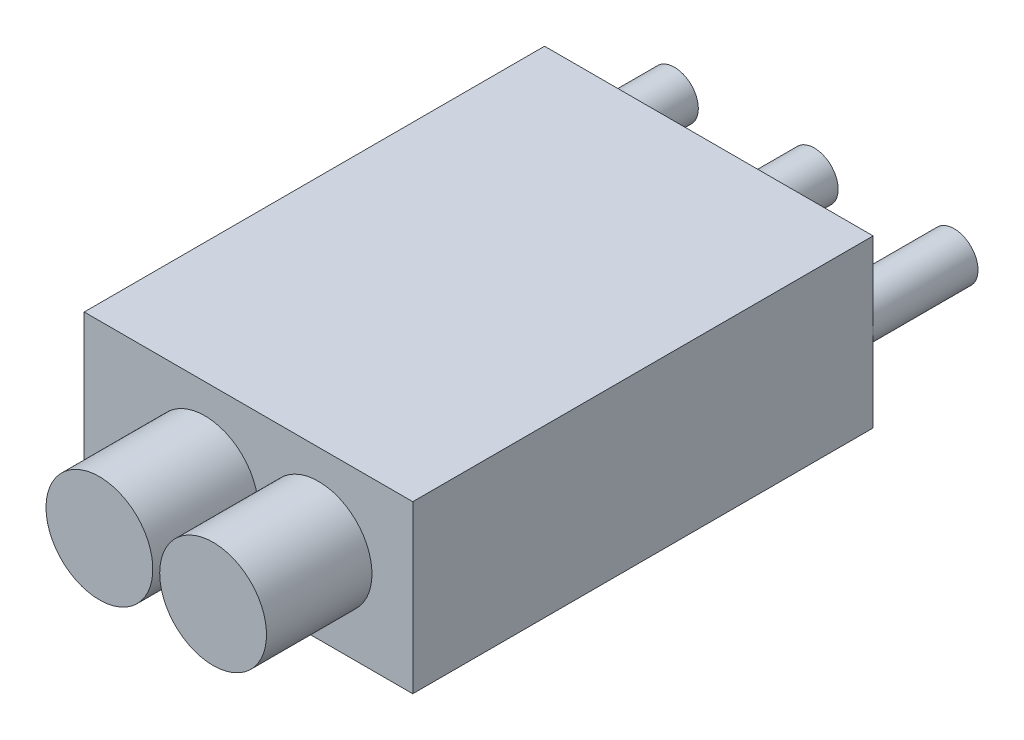
ISO-10303-21;
HEADER;
FILE_DESCRIPTION(('STEP AP214'),'2;1');
FILE_NAME('part.step','',(''),(''),'','','');
FILE_SCHEMA(('AUTOMOTIVE_DESIGN { 1 0 10303 214 1 1 1 1 }'));
ENDSEC;
DATA;
#1=APPLICATION_CONTEXT('core data for automotive mechanical design processes');
#2=APPLICATION_PROTOCOL_DEFINITION('international standard','automotive_design',2000,#1);
#3=PRODUCT_CONTEXT('',#1,'mechanical');
#4=PRODUCT('Part','Part','',(#3));
#5=PRODUCT_RELATED_PRODUCT_CATEGORY('part','',(#4));
#6=PRODUCT_DEFINITION_FORMATION('','',#4);
#7=PRODUCT_DEFINITION_CONTEXT('part definition',#1,'design');
#8=PRODUCT_DEFINITION('design','',#6,#7);
#9=PRODUCT_DEFINITION_SHAPE('','',#8);
#10=(LENGTH_UNIT() NAMED_UNIT(*) SI_UNIT(.MILLI.,.METRE.));
#11=(NAMED_UNIT(*) PLANE_ANGLE_UNIT() SI_UNIT($,.RADIAN.));
#12=(NAMED_UNIT(*) SI_UNIT($,.STERADIAN.) SOLID_ANGLE_UNIT());
#13=UNCERTAINTY_MEASURE_WITH_UNIT(LENGTH_MEASURE(1.E-05),#10,'distance_accuracy_value','');
#14=(GEOMETRIC_REPRESENTATION_CONTEXT(3) GLOBAL_UNCERTAINTY_ASSIGNED_CONTEXT((#13)) GLOBAL_UNIT_ASSIGNED_CONTEXT((#10,
#11,#12)) REPRESENTATION_CONTEXT('',''));
#15=CARTESIAN_POINT('',(0.,0.,0.));
#16=DIRECTION('',(0.,0.,1.));
#17=DIRECTION('',(1.,0.,0.));
#18=AXIS2_PLACEMENT_3D('',#15,#16,#17);
#19=CARTESIAN_POINT('',(-15.58,15.78,21.83));
#20=DIRECTION('',(1.,0.,0.));
#21=DIRECTION('',(0.,0.,-1.));
#22=AXIS2_PLACEMENT_3D('',#19,#20,#21);
#23=PLANE('',#22);
#24=DIRECTION('',(0.,0.,1.));
#25=VECTOR('',#24,1.);
#26=CARTESIAN_POINT('',(-15.58,0.,21.83));
#27=LINE('',#26,#25);
#28=CARTESIAN_POINT('',(-15.58,0.,-21.83));
#29=VERTEX_POINT('',#28);
#30=CARTESIAN_POINT('',(-15.58,0.,21.83));
#31=VERTEX_POINT('',#30);
#32=EDGE_CURVE('E114',#29,#31,#27,.T.);
#33=ORIENTED_EDGE('',*,*,#32,.T.);
#34=DIRECTION('',(0.,-1.,0.));
#35=VECTOR('',#34,1.);
#36=CARTESIAN_POINT('',(-15.58,15.78,21.83));
#37=LINE('',#36,#35);
#38=CARTESIAN_POINT('',(-15.58,15.78,21.83));
#39=VERTEX_POINT('',#38);
#40=EDGE_CURVE('E103',#39,#31,#37,.T.);
#41=ORIENTED_EDGE('',*,*,#40,.F.);
#42=DIRECTION('',(0.,0.,1.));
#43=VECTOR('',#42,1.);
#44=CARTESIAN_POINT('',(-15.58,15.78,21.83));
#45=LINE('',#44,#43);
#46=CARTESIAN_POINT('',(-15.58,15.78,-21.83));
#47=VERTEX_POINT('',#46);
#48=EDGE_CURVE('E95',#47,#39,#45,.T.);
#49=ORIENTED_EDGE('',*,*,#48,.F.);
#50=DIRECTION('',(0.,-1.,0.));
#51=VECTOR('',#50,1.);
#52=CARTESIAN_POINT('',(-15.58,15.78,-21.83));
#53=LINE('',#52,#51);
#54=EDGE_CURVE('E110',#47,#29,#53,.T.);
#55=ORIENTED_EDGE('',*,*,#54,.T.);
#56=EDGE_LOOP('',(#33,#41,#49,#55));
#57=FACE_BOUND('',#56,.T.);
#58=ADVANCED_FACE('F42',(#57),#23,.F.);
#59=CARTESIAN_POINT('',(15.58,15.78,21.83));
#60=DIRECTION('',(0.,0.,-1.));
#61=DIRECTION('',(-1.,0.,0.));
#62=AXIS2_PLACEMENT_3D('',#59,#60,#61);
#63=PLANE('',#62);
#64=CARTESIAN_POINT('',(6.64344064831066,7.91478895764295,21.83));
#65=DIRECTION('',(0.,0.,-1.));
#66=DIRECTION('',(-1.,0.,0.));
#67=AXIS2_PLACEMENT_3D('',#64,#65,#66);
#68=CIRCLE('',#67,5.065);
#69=CARTESIAN_POINT('',(1.57844064831066,7.91478895764295,21.83));
#70=VERTEX_POINT('',#69);
#71=EDGE_CURVE('E324',#70,#70,#68,.T.);
#72=ORIENTED_EDGE('',*,*,#71,.T.);
#73=EDGE_LOOP('',(#72));
#74=FACE_BOUND('',#73,.T.);
#75=CARTESIAN_POINT('',(-4.13975592637268,7.91478895764295,21.83));
#76=DIRECTION('',(0.,0.,-1.));
#77=DIRECTION('',(-1.,0.,0.));
#78=AXIS2_PLACEMENT_3D('',#75,#76,#77);
#79=CIRCLE('',#78,5.065);
#80=CARTESIAN_POINT('',(-9.20475592637268,7.91478895764295,21.83));
#81=VERTEX_POINT('',#80);
#82=EDGE_CURVE('E328',#81,#81,#79,.T.);
#83=ORIENTED_EDGE('',*,*,#82,.T.);
#84=EDGE_LOOP('',(#83));
#85=FACE_BOUND('',#84,.T.);
#86=DIRECTION('',(1.,0.,0.));
#87=VECTOR('',#86,1.);
#88=CARTESIAN_POINT('',(15.58,0.,21.83));
#89=LINE('',#88,#87);
#90=CARTESIAN_POINT('',(15.58,0.,21.83));
#91=VERTEX_POINT('',#90);
#92=EDGE_CURVE('E101',#31,#91,#89,.T.);
#93=ORIENTED_EDGE('',*,*,#92,.T.);
#94=DIRECTION('',(0.,-1.,0.));
#95=VECTOR('',#94,1.);
#96=CARTESIAN_POINT('',(15.58,15.78,21.83));
#97=LINE('',#96,#95);
#98=CARTESIAN_POINT('',(15.58,15.78,21.83));
#99=VERTEX_POINT('',#98);
#100=EDGE_CURVE('E99',#99,#91,#97,.T.);
#101=ORIENTED_EDGE('',*,*,#100,.F.);
#102=DIRECTION('',(1.,0.,0.));
#103=VECTOR('',#102,1.);
#104=CARTESIAN_POINT('',(15.58,15.78,21.83));
#105=LINE('',#104,#103);
#106=EDGE_CURVE('E90',#39,#99,#105,.T.);
#107=ORIENTED_EDGE('',*,*,#106,.F.);
#108=ORIENTED_EDGE('',*,*,#40,.T.);
#109=EDGE_LOOP('',(#93,#101,#107,#108));
#110=FACE_BOUND('',#109,.T.);
#111=ADVANCED_FACE('F100',(#74,#85,#110),#63,.F.);
#112=CARTESIAN_POINT('',(15.58,15.78,21.83));
#113=DIRECTION('',(-1.,0.,0.));
#114=DIRECTION('',(0.,0.,1.));
#115=AXIS2_PLACEMENT_3D('',#112,#113,#114);
#116=PLANE('',#115);
#117=DIRECTION('',(0.,0.,-1.));
#118=VECTOR('',#117,1.);
#119=CARTESIAN_POINT('',(15.58,0.,21.83));
#120=LINE('',#119,#118);
#121=CARTESIAN_POINT('',(15.58,0.,-21.83));
#122=VERTEX_POINT('',#121);
#123=EDGE_CURVE('E76',#91,#122,#120,.T.);
#124=ORIENTED_EDGE('',*,*,#123,.T.);
#125=DIRECTION('',(0.,-1.,0.));
#126=VECTOR('',#125,1.);
#127=CARTESIAN_POINT('',(15.58,15.78,-21.83));
#128=LINE('',#127,#126);
#129=CARTESIAN_POINT('',(15.58,15.78,-21.83));
#130=VERTEX_POINT('',#129);
#131=EDGE_CURVE('E104',#130,#122,#128,.T.);
#132=ORIENTED_EDGE('',*,*,#131,.F.);
#133=DIRECTION('',(0.,0.,-1.));
#134=VECTOR('',#133,1.);
#135=CARTESIAN_POINT('',(15.58,15.78,21.83));
#136=LINE('',#135,#134);
#137=EDGE_CURVE('E93',#99,#130,#136,.T.);
#138=ORIENTED_EDGE('',*,*,#137,.F.);
#139=ORIENTED_EDGE('',*,*,#100,.T.);
#140=EDGE_LOOP('',(#124,#132,#138,#139));
#141=FACE_BOUND('',#140,.T.);
#142=ADVANCED_FACE('F106',(#141),#116,.F.);
#143=CARTESIAN_POINT('',(15.58,15.78,-21.83));
#144=DIRECTION('',(0.,0.,1.));
#145=DIRECTION('',(1.,0.,0.));
#146=AXIS2_PLACEMENT_3D('',#143,#144,#145);
#147=PLANE('',#146);
#148=CARTESIAN_POINT('',(-13.2620923389784,7.94959919089981,-21.83));
#149=DIRECTION('',(0.,0.,1.));
#150=DIRECTION('',(1.,0.,0.));
#151=AXIS2_PLACEMENT_3D('',#148,#149,#150);
#152=CIRCLE('',#151,2.265);
#153=CARTESIAN_POINT('',(-10.9970923389784,7.94959919089981,-21.83));
#154=VERTEX_POINT('',#153);
#155=EDGE_CURVE('E11',#154,#154,#152,.F.);
#156=ORIENTED_EDGE('',*,*,#155,.F.);
#157=EDGE_LOOP('',(#156));
#158=FACE_BOUND('',#157,.T.);
#159=CARTESIAN_POINT('',(0.,7.94959919089981,-21.83));
#160=DIRECTION('',(0.,0.,1.));
#161=DIRECTION('',(1.,0.,0.));
#162=AXIS2_PLACEMENT_3D('',#159,#160,#161);
#163=CIRCLE('',#162,2.265);
#164=CARTESIAN_POINT('',(2.265,7.94959919089981,-21.83));
#165=VERTEX_POINT('',#164);
#166=EDGE_CURVE('E51',#165,#165,#163,.F.);
#167=ORIENTED_EDGE('',*,*,#166,.F.);
#168=EDGE_LOOP('',(#167));
#169=FACE_BOUND('',#168,.T.);
#170=CARTESIAN_POINT('',(13.2620923389784,7.94959919089981,-21.83));
#171=DIRECTION('',(0.,0.,1.));
#172=DIRECTION('',(1.,0.,0.));
#173=AXIS2_PLACEMENT_3D('',#170,#171,#172);
#174=CIRCLE('',#173,2.265);
#175=CARTESIAN_POINT('',(15.5270923389784,7.94959919089981,-21.83));
#176=VERTEX_POINT('',#175);
#177=EDGE_CURVE('E131',#176,#176,#174,.F.);
#178=ORIENTED_EDGE('',*,*,#177,.F.);
#179=EDGE_LOOP('',(#178));
#180=FACE_BOUND('',#179,.T.);
#181=DIRECTION('',(-1.,0.,0.));
#182=VECTOR('',#181,1.);
#183=CARTESIAN_POINT('',(15.58,0.,-21.83));
#184=LINE('',#183,#182);
#185=EDGE_CURVE('E82',#122,#29,#184,.T.);
#186=ORIENTED_EDGE('',*,*,#185,.T.);
#187=ORIENTED_EDGE('',*,*,#54,.F.);
#188=DIRECTION('',(-1.,0.,0.));
#189=VECTOR('',#188,1.);
#190=CARTESIAN_POINT('',(15.58,15.78,-21.83));
#191=LINE('',#190,#189);
#192=EDGE_CURVE('E59',#130,#47,#191,.T.);
#193=ORIENTED_EDGE('',*,*,#192,.F.);
#194=ORIENTED_EDGE('',*,*,#131,.T.);
#195=EDGE_LOOP('',(#186,#187,#193,#194));
#196=FACE_BOUND('',#195,.T.);
#197=ADVANCED_FACE('F140',(#158,#169,#180,#196),#147,.F.);
#198=CARTESIAN_POINT('',(0.,15.78,0.));
#199=DIRECTION('',(0.,1.,0.));
#200=DIRECTION('',(0.,0.,1.));
#201=AXIS2_PLACEMENT_3D('',#198,#199,#200);
#202=PLANE('',#201);
#203=ORIENTED_EDGE('',*,*,#48,.T.);
#204=ORIENTED_EDGE('',*,*,#106,.T.);
#205=ORIENTED_EDGE('',*,*,#137,.T.);
#206=ORIENTED_EDGE('',*,*,#192,.T.);
#207=EDGE_LOOP('',(#203,#204,#205,#206));
#208=FACE_BOUND('',#207,.T.);
#209=ADVANCED_FACE('F91',(#208),#202,.T.);
#210=CARTESIAN_POINT('',(0.,0.,0.));
#211=DIRECTION('',(0.,1.,0.));
#212=DIRECTION('',(0.,0.,1.));
#213=AXIS2_PLACEMENT_3D('',#210,#211,#212);
#214=PLANE('',#213);
#215=ORIENTED_EDGE('',*,*,#32,.F.);
#216=ORIENTED_EDGE('',*,*,#185,.F.);
#217=ORIENTED_EDGE('',*,*,#123,.F.);
#218=ORIENTED_EDGE('',*,*,#92,.F.);
#219=EDGE_LOOP('',(#215,#216,#217,#218));
#220=FACE_BOUND('',#219,.T.);
#221=ADVANCED_FACE('F172',(#220),#214,.F.);
#222=CARTESIAN_POINT('',(-4.13975592637268,7.91478895764295,31.83));
#223=DIRECTION('',(0.,0.,-1.));
#224=DIRECTION('',(-1.,0.,0.));
#225=AXIS2_PLACEMENT_3D('',#222,#223,#224);
#226=CYLINDRICAL_SURFACE('',#225,5.065);
#227=CARTESIAN_POINT('',(-4.13975592637268,7.91478895764295,31.83));
#228=DIRECTION('',(0.,0.,-1.));
#229=DIRECTION('',(-1.,0.,0.));
#230=AXIS2_PLACEMENT_3D('',#227,#228,#229);
#231=CIRCLE('',#230,5.065);
#232=CARTESIAN_POINT('',(-9.20475592637268,7.91478895764295,31.83));
#233=VERTEX_POINT('',#232);
#234=EDGE_CURVE('E118',#233,#233,#231,.T.);
#235=ORIENTED_EDGE('',*,*,#234,.T.);
#236=EDGE_LOOP('',(#235));
#237=FACE_BOUND('',#236,.T.);
#238=ORIENTED_EDGE('',*,*,#82,.F.);
#239=EDGE_LOOP('',(#238));
#240=FACE_BOUND('',#239,.T.);
#241=ADVANCED_FACE('F174',(#237,#240),#226,.T.);
#242=CARTESIAN_POINT('',(-4.13975592637268,7.91478895764295,31.83));
#243=DIRECTION('',(0.,0.,-1.));
#244=DIRECTION('',(-1.,0.,0.));
#245=AXIS2_PLACEMENT_3D('',#242,#243,#244);
#246=PLANE('',#245);
#247=ORIENTED_EDGE('',*,*,#234,.F.);
#248=EDGE_LOOP('',(#247));
#249=FACE_BOUND('',#248,.T.);
#250=ADVANCED_FACE('F180',(#249),#246,.F.);
#251=CARTESIAN_POINT('',(6.64344064831066,7.91478895764295,31.83));
#252=DIRECTION('',(0.,0.,-1.));
#253=DIRECTION('',(-1.,0.,0.));
#254=AXIS2_PLACEMENT_3D('',#251,#252,#253);
#255=CYLINDRICAL_SURFACE('',#254,5.065);
#256=CARTESIAN_POINT('',(6.64344064831066,7.91478895764295,31.83));
#257=DIRECTION('',(0.,0.,-1.));
#258=DIRECTION('',(-1.,0.,0.));
#259=AXIS2_PLACEMENT_3D('',#256,#257,#258);
#260=CIRCLE('',#259,5.065);
#261=CARTESIAN_POINT('',(1.57844064831066,7.91478895764295,31.83));
#262=VERTEX_POINT('',#261);
#263=EDGE_CURVE('E323',#262,#262,#260,.T.);
#264=ORIENTED_EDGE('',*,*,#263,.T.);
#265=EDGE_LOOP('',(#264));
#266=FACE_BOUND('',#265,.T.);
#267=ORIENTED_EDGE('',*,*,#71,.F.);
#268=EDGE_LOOP('',(#267));
#269=FACE_BOUND('',#268,.T.);
#270=ADVANCED_FACE('F159',(#266,#269),#255,.T.);
#271=CARTESIAN_POINT('',(6.64344064831066,7.91478895764295,31.83));
#272=DIRECTION('',(0.,0.,-1.));
#273=DIRECTION('',(-1.,0.,0.));
#274=AXIS2_PLACEMENT_3D('',#271,#272,#273);
#275=PLANE('',#274);
#276=ORIENTED_EDGE('',*,*,#263,.F.);
#277=EDGE_LOOP('',(#276));
#278=FACE_BOUND('',#277,.T.);
#279=ADVANCED_FACE('F150',(#278),#275,.F.);
#280=CARTESIAN_POINT('',(13.2620923389784,7.94959919089981,-31.83));
#281=DIRECTION('',(0.,0.,1.));
#282=DIRECTION('',(1.,0.,0.));
#283=AXIS2_PLACEMENT_3D('',#280,#281,#282);
#284=CYLINDRICAL_SURFACE('',#283,2.265);
#285=CARTESIAN_POINT('',(13.2620923389784,7.94959919089981,-31.83));
#286=DIRECTION('',(0.,0.,-1.));
#287=DIRECTION('',(-1.,0.,0.));
#288=AXIS2_PLACEMENT_3D('',#285,#286,#287);
#289=CIRCLE('',#288,2.265);
#290=CARTESIAN_POINT('',(10.9970923389784,7.94959919089981,-31.83));
#291=VERTEX_POINT('',#290);
#292=EDGE_CURVE('E317',#291,#291,#289,.T.);
#293=ORIENTED_EDGE('',*,*,#292,.F.);
#294=EDGE_LOOP('',(#293));
#295=FACE_BOUND('',#294,.T.);
#296=ORIENTED_EDGE('',*,*,#177,.T.);
#297=EDGE_LOOP('',(#296));
#298=FACE_BOUND('',#297,.T.);
#299=ADVANCED_FACE('F147',(#295,#298),#284,.T.);
#300=CARTESIAN_POINT('',(13.2620923389784,7.94959919089981,-31.83));
#301=DIRECTION('',(0.,0.,-1.));
#302=DIRECTION('',(-1.,0.,0.));
#303=AXIS2_PLACEMENT_3D('',#300,#301,#302);
#304=PLANE('',#303);
#305=ORIENTED_EDGE('',*,*,#292,.T.);
#306=EDGE_LOOP('',(#305));
#307=FACE_BOUND('',#306,.T.);
#308=ADVANCED_FACE('F149',(#307),#304,.T.);
#309=CARTESIAN_POINT('',(0.,7.94959919089981,-31.83));
#310=DIRECTION('',(0.,0.,1.));
#311=DIRECTION('',(1.,0.,0.));
#312=AXIS2_PLACEMENT_3D('',#309,#310,#311);
#313=CYLINDRICAL_SURFACE('',#312,2.265);
#314=CARTESIAN_POINT('',(0.,7.94959919089981,-31.83));
#315=DIRECTION('',(0.,0.,-1.));
#316=DIRECTION('',(-1.,0.,0.));
#317=AXIS2_PLACEMENT_3D('',#314,#315,#316);
#318=CIRCLE('',#317,2.265);
#319=CARTESIAN_POINT('',(-2.26500000000001,7.94959919089981,-31.83));
#320=VERTEX_POINT('',#319);
#321=EDGE_CURVE('E313',#320,#320,#318,.T.);
#322=ORIENTED_EDGE('',*,*,#321,.F.);
#323=EDGE_LOOP('',(#322));
#324=FACE_BOUND('',#323,.T.);
#325=ORIENTED_EDGE('',*,*,#166,.T.);
#326=EDGE_LOOP('',(#325));
#327=FACE_BOUND('',#326,.T.);
#328=ADVANCED_FACE('F138',(#324,#327),#313,.T.);
#329=CARTESIAN_POINT('',(0.,7.94959919089981,-31.83));
#330=DIRECTION('',(0.,0.,-1.));
#331=DIRECTION('',(-1.,0.,0.));
#332=AXIS2_PLACEMENT_3D('',#329,#330,#331);
#333=PLANE('',#332);
#334=ORIENTED_EDGE('',*,*,#321,.T.);
#335=EDGE_LOOP('',(#334));
#336=FACE_BOUND('',#335,.T.);
#337=ADVANCED_FACE('F268',(#336),#333,.T.);
#338=CARTESIAN_POINT('',(-13.2620923389784,7.94959919089981,-31.83));
#339=DIRECTION('',(0.,0.,1.));
#340=DIRECTION('',(1.,0.,0.));
#341=AXIS2_PLACEMENT_3D('',#338,#339,#340);
#342=CYLINDRICAL_SURFACE('',#341,2.265);
#343=CARTESIAN_POINT('',(-13.2620923389784,7.94959919089981,-31.83));
#344=DIRECTION('',(0.,0.,-1.));
#345=DIRECTION('',(-1.,0.,0.));
#346=AXIS2_PLACEMENT_3D('',#343,#344,#345);
#347=CIRCLE('',#346,2.265);
#348=CARTESIAN_POINT('',(-15.5270923389784,7.94959919089981,-31.83));
#349=VERTEX_POINT('',#348);
#350=EDGE_CURVE('E311',#349,#349,#347,.T.);
#351=ORIENTED_EDGE('',*,*,#350,.F.);
#352=EDGE_LOOP('',(#351));
#353=FACE_BOUND('',#352,.T.);
#354=ORIENTED_EDGE('',*,*,#155,.T.);
#355=EDGE_LOOP('',(#354));
#356=FACE_BOUND('',#355,.T.);
#357=ADVANCED_FACE('F279',(#353,#356),#342,.T.);
#358=CARTESIAN_POINT('',(-13.2620923389784,7.94959919089981,-31.83));
#359=DIRECTION('',(0.,0.,-1.));
#360=DIRECTION('',(-1.,0.,0.));
#361=AXIS2_PLACEMENT_3D('',#358,#359,#360);
#362=PLANE('',#361);
#363=ORIENTED_EDGE('',*,*,#350,.T.);
#364=EDGE_LOOP('',(#363));
#365=FACE_BOUND('',#364,.T.);
#366=ADVANCED_FACE('F290',(#365),#362,.T.);
#367=CLOSED_SHELL('',(#58,#111,#142,#197,#209,#221,#241,#250,#270,#279,#299,#308,#328,#337,#357,#366));
#368=MANIFOLD_SOLID_BREP('B2',#367);
#369=ADVANCED_BREP_SHAPE_REPRESENTATION('',(#18,#368),#14);
#370=SHAPE_DEFINITION_REPRESENTATION(#9,#369);
ENDSEC;
END-ISO-10303-21;
